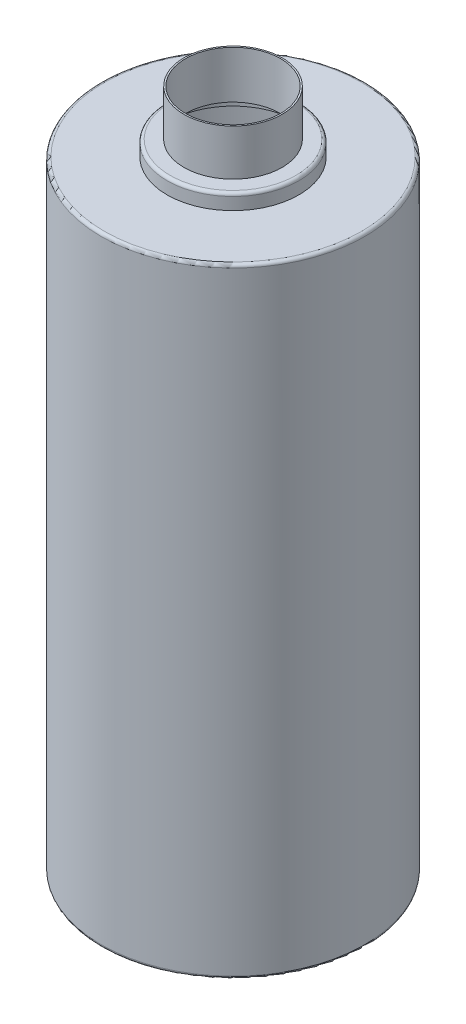
ISO-10303-21;
HEADER;
FILE_DESCRIPTION(('STEP AP214'),'2;1');
FILE_NAME('part.step','',(''),(''),'','','');
FILE_SCHEMA(('AUTOMOTIVE_DESIGN { 1 0 10303 214 1 1 1 1 }'));
ENDSEC;
DATA;
#1=APPLICATION_CONTEXT('core data for automotive mechanical design processes');
#2=APPLICATION_PROTOCOL_DEFINITION('international standard','automotive_design',2000,#1);
#3=PRODUCT_CONTEXT('',#1,'mechanical');
#4=PRODUCT('Part','Part','',(#3));
#5=PRODUCT_RELATED_PRODUCT_CATEGORY('part','',(#4));
#6=PRODUCT_DEFINITION_FORMATION('','',#4);
#7=PRODUCT_DEFINITION_CONTEXT('part definition',#1,'design');
#8=PRODUCT_DEFINITION('design','',#6,#7);
#9=PRODUCT_DEFINITION_SHAPE('','',#8);
#10=(LENGTH_UNIT() NAMED_UNIT(*) SI_UNIT(.MILLI.,.METRE.));
#11=(NAMED_UNIT(*) PLANE_ANGLE_UNIT() SI_UNIT($,.RADIAN.));
#12=(NAMED_UNIT(*) SI_UNIT($,.STERADIAN.) SOLID_ANGLE_UNIT());
#13=UNCERTAINTY_MEASURE_WITH_UNIT(LENGTH_MEASURE(1.E-05),#10,'distance_accuracy_value','');
#14=(GEOMETRIC_REPRESENTATION_CONTEXT(3) GLOBAL_UNCERTAINTY_ASSIGNED_CONTEXT((#13)) GLOBAL_UNIT_ASSIGNED_CONTEXT((#10,
#11,#12)) REPRESENTATION_CONTEXT('',''));
#15=CARTESIAN_POINT('',(0.,0.,0.));
#16=DIRECTION('',(0.,0.,1.));
#17=DIRECTION('',(1.,0.,0.));
#18=AXIS2_PLACEMENT_3D('',#15,#16,#17);
#19=CARTESIAN_POINT('',(0.,111.,0.));
#20=DIRECTION('',(0.,-1.,0.));
#21=DIRECTION('',(0.,0.,-1.));
#22=AXIS2_PLACEMENT_3D('',#19,#20,#21);
#23=PLANE('',#22);
#24=CARTESIAN_POINT('',(0.,111.,0.));
#25=DIRECTION('',(0.,-1.,0.));
#26=DIRECTION('',(0.,0.,-1.));
#27=AXIS2_PLACEMENT_3D('',#24,#25,#26);
#28=CIRCLE('',#27,15.5);
#29=CARTESIAN_POINT('',(0.,111.,-15.5));
#30=VERTEX_POINT('',#29);
#31=EDGE_CURVE('E68',#30,#30,#28,.F.);
#32=ORIENTED_EDGE('',*,*,#31,.F.);
#33=EDGE_LOOP('',(#32));
#34=FACE_BOUND('',#33,.T.);
#35=CARTESIAN_POINT('',(0.,111.,0.));
#36=DIRECTION('',(0.,1.,0.));
#37=DIRECTION('',(0.,0.,1.));
#38=AXIS2_PLACEMENT_3D('',#35,#36,#37);
#39=CIRCLE('',#38,16.);
#40=CARTESIAN_POINT('',(0.,111.,16.));
#41=VERTEX_POINT('',#40);
#42=EDGE_CURVE('E58',#41,#41,#39,.T.);
#43=ORIENTED_EDGE('',*,*,#42,.T.);
#44=EDGE_LOOP('',(#43));
#45=FACE_BOUND('',#44,.T.);
#46=ADVANCED_FACE('F32',(#34,#45),#23,.F.);
#47=CARTESIAN_POINT('',(0.,36.9394732791237,0.));
#48=DIRECTION('',(0.,1.,0.));
#49=DIRECTION('',(0.,0.,1.));
#50=AXIS2_PLACEMENT_3D('',#47,#48,#49);
#51=CYLINDRICAL_SURFACE('',#50,16.);
#52=ORIENTED_EDGE('',*,*,#42,.F.);
#53=EDGE_LOOP('',(#52));
#54=FACE_BOUND('',#53,.T.);
#55=CARTESIAN_POINT('',(0.,96.,0.));
#56=DIRECTION('',(0.,1.,0.));
#57=DIRECTION('',(0.,0.,1.));
#58=AXIS2_PLACEMENT_3D('',#55,#56,#57);
#59=CIRCLE('',#58,16.);
#60=CARTESIAN_POINT('',(0.,96.,16.));
#61=VERTEX_POINT('',#60);
#62=EDGE_CURVE('E61',#61,#61,#59,.T.);
#63=ORIENTED_EDGE('',*,*,#62,.T.);
#64=EDGE_LOOP('',(#63));
#65=FACE_BOUND('',#64,.T.);
#66=ADVANCED_FACE('F111',(#54,#65),#51,.T.);
#67=CARTESIAN_POINT('',(16.,96.,0.));
#68=DIRECTION('',(0.,-1.,0.));
#69=DIRECTION('',(0.,0.,-1.));
#70=AXIS2_PLACEMENT_3D('',#67,#68,#69);
#71=PLANE('',#70);
#72=CARTESIAN_POINT('',(0.,96.,0.));
#73=DIRECTION('',(0.,-1.,0.));
#74=DIRECTION('',(0.,0.,-1.));
#75=AXIS2_PLACEMENT_3D('',#72,#73,#74);
#76=CIRCLE('',#75,20.5);
#77=CARTESIAN_POINT('',(0.,96.,-20.5));
#78=VERTEX_POINT('',#77);
#79=EDGE_CURVE('E43',#78,#78,#76,.F.);
#80=ORIENTED_EDGE('',*,*,#79,.T.);
#81=EDGE_LOOP('',(#80));
#82=FACE_BOUND('',#81,.T.);
#83=ORIENTED_EDGE('',*,*,#62,.F.);
#84=EDGE_LOOP('',(#83));
#85=FACE_BOUND('',#84,.T.);
#86=ADVANCED_FACE('F117',(#82,#85),#71,.F.);
#87=CARTESIAN_POINT('',(0.,36.9394732791237,0.));
#88=DIRECTION('',(0.,1.,0.));
#89=DIRECTION('',(0.,0.,1.));
#90=AXIS2_PLACEMENT_3D('',#87,#88,#89);
#91=CYLINDRICAL_SURFACE('',#90,21.5);
#92=CARTESIAN_POINT('',(0.,95.,0.));
#93=DIRECTION('',(0.,-1.,0.));
#94=DIRECTION('',(0.,0.,-1.));
#95=AXIS2_PLACEMENT_3D('',#92,#93,#94);
#96=CIRCLE('',#95,21.5);
#97=CARTESIAN_POINT('',(0.,95.,-21.5));
#98=VERTEX_POINT('',#97);
#99=EDGE_CURVE('E39',#98,#98,#96,.T.);
#100=ORIENTED_EDGE('',*,*,#99,.T.);
#101=EDGE_LOOP('',(#100));
#102=FACE_BOUND('',#101,.T.);
#103=CARTESIAN_POINT('',(0.,91.,0.));
#104=DIRECTION('',(0.,1.,0.));
#105=DIRECTION('',(0.,0.,1.));
#106=AXIS2_PLACEMENT_3D('',#103,#104,#105);
#107=CIRCLE('',#106,21.5);
#108=CARTESIAN_POINT('',(0.,91.,21.5));
#109=VERTEX_POINT('',#108);
#110=EDGE_CURVE('E64',#109,#109,#107,.T.);
#111=ORIENTED_EDGE('',*,*,#110,.T.);
#112=EDGE_LOOP('',(#111));
#113=FACE_BOUND('',#112,.T.);
#114=ADVANCED_FACE('F137',(#102,#113),#91,.T.);
#115=CARTESIAN_POINT('',(21.5,91.,0.));
#116=DIRECTION('',(0.,-1.,0.));
#117=DIRECTION('',(0.,0.,-1.));
#118=AXIS2_PLACEMENT_3D('',#115,#116,#117);
#119=PLANE('',#118);
#120=CARTESIAN_POINT('',(0.,91.,0.));
#121=DIRECTION('',(0.,-1.,0.));
#122=DIRECTION('',(0.,0.,-1.));
#123=AXIS2_PLACEMENT_3D('',#120,#121,#122);
#124=CIRCLE('',#123,42.);
#125=CARTESIAN_POINT('',(0.,91.,-42.));
#126=VERTEX_POINT('',#125);
#127=EDGE_CURVE('E10',#126,#126,#124,.F.);
#128=ORIENTED_EDGE('',*,*,#127,.T.);
#129=EDGE_LOOP('',(#128));
#130=FACE_BOUND('',#129,.T.);
#131=ORIENTED_EDGE('',*,*,#110,.F.);
#132=EDGE_LOOP('',(#131));
#133=FACE_BOUND('',#132,.T.);
#134=ADVANCED_FACE('F143',(#130,#133),#119,.F.);
#135=CARTESIAN_POINT('',(0.,36.9394732791237,0.));
#136=DIRECTION('',(0.,1.,0.));
#137=DIRECTION('',(0.,0.,1.));
#138=AXIS2_PLACEMENT_3D('',#135,#136,#137);
#139=CYLINDRICAL_SURFACE('',#138,43.);
#140=CARTESIAN_POINT('',(0.,-110.,0.));
#141=DIRECTION('',(0.,1.,0.));
#142=DIRECTION('',(0.,0.,1.));
#143=AXIS2_PLACEMENT_3D('',#140,#141,#142);
#144=CIRCLE('',#143,43.);
#145=CARTESIAN_POINT('',(0.,-110.,43.));
#146=VERTEX_POINT('',#145);
#147=EDGE_CURVE('E52',#146,#146,#144,.T.);
#148=ORIENTED_EDGE('',*,*,#147,.T.);
#149=EDGE_LOOP('',(#148));
#150=FACE_BOUND('',#149,.T.);
#151=CARTESIAN_POINT('',(0.,90.,0.));
#152=DIRECTION('',(0.,-1.,0.));
#153=DIRECTION('',(0.,0.,-1.));
#154=AXIS2_PLACEMENT_3D('',#151,#152,#153);
#155=CIRCLE('',#154,43.);
#156=CARTESIAN_POINT('',(0.,90.,-43.));
#157=VERTEX_POINT('',#156);
#158=EDGE_CURVE('E55',#157,#157,#155,.T.);
#159=ORIENTED_EDGE('',*,*,#158,.T.);
#160=EDGE_LOOP('',(#159));
#161=FACE_BOUND('',#160,.T.);
#162=ADVANCED_FACE('F148',(#150,#161),#139,.T.);
#163=CARTESIAN_POINT('',(43.,-111.,0.));
#164=DIRECTION('',(0.,1.,0.));
#165=DIRECTION('',(0.,0.,1.));
#166=AXIS2_PLACEMENT_3D('',#163,#164,#165);
#167=PLANE('',#166);
#168=CARTESIAN_POINT('',(0.,-111.,0.));
#169=DIRECTION('',(0.,1.,0.));
#170=DIRECTION('',(0.,0.,1.));
#171=AXIS2_PLACEMENT_3D('',#168,#169,#170);
#172=CIRCLE('',#171,42.);
#173=CARTESIAN_POINT('',(0.,-111.,42.));
#174=VERTEX_POINT('',#173);
#175=EDGE_CURVE('E47',#174,#174,#172,.F.);
#176=ORIENTED_EDGE('',*,*,#175,.T.);
#177=EDGE_LOOP('',(#176));
#178=FACE_BOUND('',#177,.T.);
#179=ADVANCED_FACE('F126',(#178),#167,.F.);
#180=CARTESIAN_POINT('',(0.,-110.,0.));
#181=DIRECTION('',(0.,1.,0.));
#182=DIRECTION('',(0.,0.,1.));
#183=AXIS2_PLACEMENT_3D('',#180,#181,#182);
#184=TOROIDAL_SURFACE('',#183,42.,1.);
#185=ORIENTED_EDGE('',*,*,#175,.F.);
#186=EDGE_LOOP('',(#185));
#187=FACE_BOUND('',#186,.T.);
#188=ORIENTED_EDGE('',*,*,#147,.F.);
#189=EDGE_LOOP('',(#188));
#190=FACE_BOUND('',#189,.T.);
#191=ADVANCED_FACE('F124',(#187,#190),#184,.T.);
#192=CARTESIAN_POINT('',(0.,95.,0.));
#193=DIRECTION('',(0.,-1.,0.));
#194=DIRECTION('',(0.,0.,-1.));
#195=AXIS2_PLACEMENT_3D('',#192,#193,#194);
#196=TOROIDAL_SURFACE('',#195,20.5,1.);
#197=ORIENTED_EDGE('',*,*,#99,.F.);
#198=EDGE_LOOP('',(#197));
#199=FACE_BOUND('',#198,.T.);
#200=ORIENTED_EDGE('',*,*,#79,.F.);
#201=EDGE_LOOP('',(#200));
#202=FACE_BOUND('',#201,.T.);
#203=ADVANCED_FACE('F108',(#199,#202),#196,.T.);
#204=CARTESIAN_POINT('',(0.,90.,0.));
#205=DIRECTION('',(0.,-1.,0.));
#206=DIRECTION('',(0.,0.,-1.));
#207=AXIS2_PLACEMENT_3D('',#204,#205,#206);
#208=TOROIDAL_SURFACE('',#207,42.,1.);
#209=ORIENTED_EDGE('',*,*,#158,.F.);
#210=EDGE_LOOP('',(#209));
#211=FACE_BOUND('',#210,.T.);
#212=ORIENTED_EDGE('',*,*,#127,.F.);
#213=EDGE_LOOP('',(#212));
#214=FACE_BOUND('',#213,.T.);
#215=ADVANCED_FACE('F34',(#211,#214),#208,.T.);
#216=CARTESIAN_POINT('',(0.,36.9394732791237,0.));
#217=DIRECTION('',(0.,1.,0.));
#218=DIRECTION('',(0.,0.,1.));
#219=AXIS2_PLACEMENT_3D('',#216,#217,#218);
#220=CYLINDRICAL_SURFACE('',#219,15.5);
#221=ORIENTED_EDGE('',*,*,#31,.T.);
#222=EDGE_LOOP('',(#221));
#223=FACE_BOUND('',#222,.T.);
#224=CARTESIAN_POINT('',(0.,95.5,0.));
#225=DIRECTION('',(0.,-1.,0.));
#226=DIRECTION('',(0.,0.,-1.));
#227=AXIS2_PLACEMENT_3D('',#224,#225,#226);
#228=CIRCLE('',#227,15.5);
#229=CARTESIAN_POINT('',(0.,95.5,-15.5));
#230=VERTEX_POINT('',#229);
#231=EDGE_CURVE('E72',#230,#230,#228,.F.);
#232=ORIENTED_EDGE('',*,*,#231,.F.);
#233=EDGE_LOOP('',(#232));
#234=FACE_BOUND('',#233,.T.);
#235=ADVANCED_FACE('F97',(#223,#234),#220,.F.);
#236=CARTESIAN_POINT('',(16.,95.5,0.));
#237=DIRECTION('',(0.,-1.,0.));
#238=DIRECTION('',(0.,0.,-1.));
#239=AXIS2_PLACEMENT_3D('',#236,#237,#238);
#240=PLANE('',#239);
#241=CARTESIAN_POINT('',(0.,95.5,0.));
#242=DIRECTION('',(0.,-1.,0.));
#243=DIRECTION('',(0.,0.,-1.));
#244=AXIS2_PLACEMENT_3D('',#241,#242,#243);
#245=CIRCLE('',#244,20.5);
#246=CARTESIAN_POINT('',(0.,95.5,-20.5));
#247=VERTEX_POINT('',#246);
#248=EDGE_CURVE('E76',#247,#247,#245,.F.);
#249=ORIENTED_EDGE('',*,*,#248,.F.);
#250=EDGE_LOOP('',(#249));
#251=FACE_BOUND('',#250,.T.);
#252=ORIENTED_EDGE('',*,*,#231,.T.);
#253=EDGE_LOOP('',(#252));
#254=FACE_BOUND('',#253,.T.);
#255=ADVANCED_FACE('F95',(#251,#254),#240,.T.);
#256=CARTESIAN_POINT('',(0.,36.9394732791237,0.));
#257=DIRECTION('',(0.,1.,0.));
#258=DIRECTION('',(0.,0.,1.));
#259=AXIS2_PLACEMENT_3D('',#256,#257,#258);
#260=CYLINDRICAL_SURFACE('',#259,21.);
#261=CARTESIAN_POINT('',(0.,95.,0.));
#262=DIRECTION('',(0.,1.,0.));
#263=DIRECTION('',(0.,0.,1.));
#264=AXIS2_PLACEMENT_3D('',#261,#262,#263);
#265=CIRCLE('',#264,21.);
#266=CARTESIAN_POINT('',(0.,95.,21.));
#267=VERTEX_POINT('',#266);
#268=EDGE_CURVE('E84',#267,#267,#265,.F.);
#269=ORIENTED_EDGE('',*,*,#268,.F.);
#270=EDGE_LOOP('',(#269));
#271=FACE_BOUND('',#270,.T.);
#272=CARTESIAN_POINT('',(0.,90.5,0.));
#273=DIRECTION('',(0.,-1.,0.));
#274=DIRECTION('',(0.,0.,-1.));
#275=AXIS2_PLACEMENT_3D('',#272,#273,#274);
#276=CIRCLE('',#275,21.);
#277=CARTESIAN_POINT('',(0.,90.5,-21.));
#278=VERTEX_POINT('',#277);
#279=EDGE_CURVE('E85',#278,#278,#276,.F.);
#280=ORIENTED_EDGE('',*,*,#279,.F.);
#281=EDGE_LOOP('',(#280));
#282=FACE_BOUND('',#281,.T.);
#283=ADVANCED_FACE('F105',(#271,#282),#260,.F.);
#284=CARTESIAN_POINT('',(21.5,90.5,0.));
#285=DIRECTION('',(0.,-1.,0.));
#286=DIRECTION('',(0.,0.,-1.));
#287=AXIS2_PLACEMENT_3D('',#284,#285,#286);
#288=PLANE('',#287);
#289=CARTESIAN_POINT('',(0.,90.5,0.));
#290=DIRECTION('',(0.,-1.,0.));
#291=DIRECTION('',(0.,0.,-1.));
#292=AXIS2_PLACEMENT_3D('',#289,#290,#291);
#293=CIRCLE('',#292,42.);
#294=CARTESIAN_POINT('',(0.,90.5,-42.));
#295=VERTEX_POINT('',#294);
#296=EDGE_CURVE('E67',#295,#295,#293,.F.);
#297=ORIENTED_EDGE('',*,*,#296,.F.);
#298=EDGE_LOOP('',(#297));
#299=FACE_BOUND('',#298,.T.);
#300=ORIENTED_EDGE('',*,*,#279,.T.);
#301=EDGE_LOOP('',(#300));
#302=FACE_BOUND('',#301,.T.);
#303=ADVANCED_FACE('F174',(#299,#302),#288,.T.);
#304=CARTESIAN_POINT('',(0.,36.9394732791237,0.));
#305=DIRECTION('',(0.,1.,0.));
#306=DIRECTION('',(0.,0.,1.));
#307=AXIS2_PLACEMENT_3D('',#304,#305,#306);
#308=CYLINDRICAL_SURFACE('',#307,42.5);
#309=CARTESIAN_POINT('',(0.,-110.,0.));
#310=DIRECTION('',(0.,1.,0.));
#311=DIRECTION('',(0.,0.,1.));
#312=AXIS2_PLACEMENT_3D('',#309,#310,#311);
#313=CIRCLE('',#312,42.5);
#314=CARTESIAN_POINT('',(0.,-110.,42.5));
#315=VERTEX_POINT('',#314);
#316=EDGE_CURVE('E77',#315,#315,#313,.T.);
#317=ORIENTED_EDGE('',*,*,#316,.F.);
#318=EDGE_LOOP('',(#317));
#319=FACE_BOUND('',#318,.T.);
#320=CARTESIAN_POINT('',(0.,90.,0.));
#321=DIRECTION('',(0.,1.,0.));
#322=DIRECTION('',(0.,0.,1.));
#323=AXIS2_PLACEMENT_3D('',#320,#321,#322);
#324=CIRCLE('',#323,42.5);
#325=CARTESIAN_POINT('',(0.,90.,42.5));
#326=VERTEX_POINT('',#325);
#327=EDGE_CURVE('E71',#326,#326,#324,.F.);
#328=ORIENTED_EDGE('',*,*,#327,.F.);
#329=EDGE_LOOP('',(#328));
#330=FACE_BOUND('',#329,.T.);
#331=ADVANCED_FACE('F170',(#319,#330),#308,.F.);
#332=CARTESIAN_POINT('',(43.,-110.5,0.));
#333=DIRECTION('',(0.,1.,0.));
#334=DIRECTION('',(0.,0.,1.));
#335=AXIS2_PLACEMENT_3D('',#332,#333,#334);
#336=PLANE('',#335);
#337=CARTESIAN_POINT('',(0.,-110.5,0.));
#338=DIRECTION('',(0.,1.,0.));
#339=DIRECTION('',(0.,0.,1.));
#340=AXIS2_PLACEMENT_3D('',#337,#338,#339);
#341=CIRCLE('',#340,42.);
#342=CARTESIAN_POINT('',(0.,-110.5,42.));
#343=VERTEX_POINT('',#342);
#344=EDGE_CURVE('E73',#343,#343,#341,.F.);
#345=ORIENTED_EDGE('',*,*,#344,.F.);
#346=EDGE_LOOP('',(#345));
#347=FACE_BOUND('',#346,.T.);
#348=ADVANCED_FACE('F166',(#347),#336,.T.);
#349=CARTESIAN_POINT('',(0.,-110.,0.));
#350=DIRECTION('',(0.,1.,0.));
#351=DIRECTION('',(0.,0.,1.));
#352=AXIS2_PLACEMENT_3D('',#349,#350,#351);
#353=TOROIDAL_SURFACE('',#352,42.,0.5);
#354=ORIENTED_EDGE('',*,*,#344,.T.);
#355=EDGE_LOOP('',(#354));
#356=FACE_BOUND('',#355,.T.);
#357=ORIENTED_EDGE('',*,*,#316,.T.);
#358=EDGE_LOOP('',(#357));
#359=FACE_BOUND('',#358,.T.);
#360=ADVANCED_FACE('F162',(#356,#359),#353,.F.);
#361=CARTESIAN_POINT('',(0.,95.,0.));
#362=DIRECTION('',(0.,-1.,0.));
#363=DIRECTION('',(0.,0.,-1.));
#364=AXIS2_PLACEMENT_3D('',#361,#362,#363);
#365=TOROIDAL_SURFACE('',#364,20.5,0.5);
#366=ORIENTED_EDGE('',*,*,#268,.T.);
#367=EDGE_LOOP('',(#366));
#368=FACE_BOUND('',#367,.T.);
#369=ORIENTED_EDGE('',*,*,#248,.T.);
#370=EDGE_LOOP('',(#369));
#371=FACE_BOUND('',#370,.T.);
#372=ADVANCED_FACE('F158',(#368,#371),#365,.F.);
#373=CARTESIAN_POINT('',(0.,90.,0.));
#374=DIRECTION('',(0.,-1.,0.));
#375=DIRECTION('',(0.,0.,-1.));
#376=AXIS2_PLACEMENT_3D('',#373,#374,#375);
#377=TOROIDAL_SURFACE('',#376,42.,0.5);
#378=ORIENTED_EDGE('',*,*,#327,.T.);
#379=EDGE_LOOP('',(#378));
#380=FACE_BOUND('',#379,.T.);
#381=ORIENTED_EDGE('',*,*,#296,.T.);
#382=EDGE_LOOP('',(#381));
#383=FACE_BOUND('',#382,.T.);
#384=ADVANCED_FACE('F155',(#380,#383),#377,.F.);
#385=CLOSED_SHELL('',(#46,#66,#86,#114,#134,#162,#179,#191,#203,#215,#235,#255,#283,#303,#331,
#348,#360,#372,#384));
#386=MANIFOLD_SOLID_BREP('B2',#385);
#387=ADVANCED_BREP_SHAPE_REPRESENTATION('',(#18,#386),#14);
#388=SHAPE_DEFINITION_REPRESENTATION(#9,#387);
ENDSEC;
END-ISO-10303-21;
